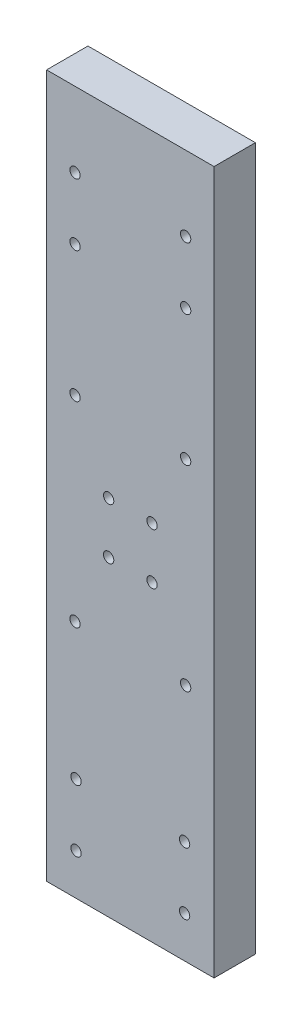
ISO-10303-21;
HEADER;
FILE_DESCRIPTION(('STEP AP214'),'2;1');
FILE_NAME('part.step','',(''),(''),'','','');
FILE_SCHEMA(('AUTOMOTIVE_DESIGN { 1 0 10303 214 1 1 1 1 }'));
ENDSEC;
DATA;
#1=APPLICATION_CONTEXT('core data for automotive mechanical design processes');
#2=APPLICATION_PROTOCOL_DEFINITION('international standard','automotive_design',2000,#1);
#3=PRODUCT_CONTEXT('',#1,'mechanical');
#4=PRODUCT('Part','Part','',(#3));
#5=PRODUCT_RELATED_PRODUCT_CATEGORY('part','',(#4));
#6=PRODUCT_DEFINITION_FORMATION('','',#4);
#7=PRODUCT_DEFINITION_CONTEXT('part definition',#1,'design');
#8=PRODUCT_DEFINITION('design','',#6,#7);
#9=PRODUCT_DEFINITION_SHAPE('','',#8);
#10=(LENGTH_UNIT() NAMED_UNIT(*) SI_UNIT(.MILLI.,.METRE.));
#11=(NAMED_UNIT(*) PLANE_ANGLE_UNIT() SI_UNIT($,.RADIAN.));
#12=(NAMED_UNIT(*) SI_UNIT($,.STERADIAN.) SOLID_ANGLE_UNIT());
#13=UNCERTAINTY_MEASURE_WITH_UNIT(LENGTH_MEASURE(1.E-05),#10,'distance_accuracy_value','');
#14=(GEOMETRIC_REPRESENTATION_CONTEXT(3) GLOBAL_UNCERTAINTY_ASSIGNED_CONTEXT((#13)) GLOBAL_UNIT_ASSIGNED_CONTEXT((#10,
#11,#12)) REPRESENTATION_CONTEXT('',''));
#15=CARTESIAN_POINT('',(0.,0.,0.));
#16=DIRECTION('',(0.,0.,1.));
#17=DIRECTION('',(1.,0.,0.));
#18=AXIS2_PLACEMENT_3D('',#15,#16,#17);
#19=CARTESIAN_POINT('',(0.,0.,4.));
#20=DIRECTION('',(0.,0.,-1.));
#21=DIRECTION('',(-1.,0.,0.));
#22=AXIS2_PLACEMENT_3D('',#19,#20,#21);
#23=PLANE('',#22);
#24=CARTESIAN_POINT('',(13.350000000001,4.,4.));
#25=DIRECTION('',(0.,0.,1.));
#26=DIRECTION('',(-1.,0.,0.));
#27=AXIS2_PLACEMENT_3D('',#24,#25,#26);
#28=CIRCLE('',#27,0.499999999999995);
#29=CARTESIAN_POINT('',(12.850000000001,4.,4.));
#30=VERTEX_POINT('',#29);
#31=EDGE_CURVE('E193',#30,#30,#28,.T.);
#32=ORIENTED_EDGE('',*,*,#31,.F.);
#33=EDGE_LOOP('',(#32));
#34=FACE_BOUND('',#33,.T.);
#35=CARTESIAN_POINT('',(2.84999999999999,4.,4.));
#36=DIRECTION('',(0.,0.,1.));
#37=DIRECTION('',(1.,0.,0.));
#38=AXIS2_PLACEMENT_3D('',#35,#36,#37);
#39=CIRCLE('',#38,0.499999999999999);
#40=CARTESIAN_POINT('',(3.34999999999999,4.,4.));
#41=VERTEX_POINT('',#40);
#42=EDGE_CURVE('E181',#41,#41,#39,.T.);
#43=ORIENTED_EDGE('',*,*,#42,.F.);
#44=EDGE_LOOP('',(#43));
#45=FACE_BOUND('',#44,.T.);
#46=CARTESIAN_POINT('',(2.75000000000003,42.11,4.));
#47=DIRECTION('',(0.,0.,1.));
#48=DIRECTION('',(1.,0.,0.));
#49=AXIS2_PLACEMENT_3D('',#46,#47,#48);
#50=CIRCLE('',#49,0.499999999999999);
#51=CARTESIAN_POINT('',(3.25000000000003,42.11,4.));
#52=VERTEX_POINT('',#51);
#53=EDGE_CURVE('E169',#52,#52,#50,.T.);
#54=ORIENTED_EDGE('',*,*,#53,.F.);
#55=EDGE_LOOP('',(#54));
#56=FACE_BOUND('',#55,.T.);
#57=CARTESIAN_POINT('',(13.45,42.11,4.));
#58=DIRECTION('',(0.,0.,1.));
#59=DIRECTION('',(1.,0.,0.));
#60=AXIS2_PLACEMENT_3D('',#57,#58,#59);
#61=CIRCLE('',#60,0.499999999999999);
#62=CARTESIAN_POINT('',(13.95,42.11,4.));
#63=VERTEX_POINT('',#62);
#64=EDGE_CURVE('E157',#63,#63,#61,.T.);
#65=ORIENTED_EDGE('',*,*,#64,.F.);
#66=EDGE_LOOP('',(#65));
#67=FACE_BOUND('',#66,.T.);
#68=CARTESIAN_POINT('',(2.75000000000003,23.15,4.));
#69=DIRECTION('',(0.,0.,1.));
#70=DIRECTION('',(1.,0.,0.));
#71=AXIS2_PLACEMENT_3D('',#68,#69,#70);
#72=CIRCLE('',#71,0.499999999999999);
#73=CARTESIAN_POINT('',(3.25000000000003,23.15,4.));
#74=VERTEX_POINT('',#73);
#75=EDGE_CURVE('E145',#74,#74,#72,.T.);
#76=ORIENTED_EDGE('',*,*,#75,.F.);
#77=EDGE_LOOP('',(#76));
#78=FACE_BOUND('',#77,.T.);
#79=CARTESIAN_POINT('',(13.4500000000001,23.15,4.));
#80=DIRECTION('',(0.,0.,1.));
#81=DIRECTION('',(1.,0.,0.));
#82=AXIS2_PLACEMENT_3D('',#79,#80,#81);
#83=CIRCLE('',#82,0.499999999999999);
#84=CARTESIAN_POINT('',(13.9500000000001,23.15,4.));
#85=VERTEX_POINT('',#84);
#86=EDGE_CURVE('E133',#85,#85,#83,.T.);
#87=ORIENTED_EDGE('',*,*,#86,.F.);
#88=EDGE_LOOP('',(#87));
#89=FACE_BOUND('',#88,.T.);
#90=CARTESIAN_POINT('',(10.2000000000001,30.15,4.));
#91=DIRECTION('',(0.,0.,1.));
#92=DIRECTION('',(1.,0.,0.));
#93=AXIS2_PLACEMENT_3D('',#90,#91,#92);
#94=CIRCLE('',#93,0.499999999999999);
#95=CARTESIAN_POINT('',(10.7000000000001,30.15,4.));
#96=VERTEX_POINT('',#95);
#97=EDGE_CURVE('E121',#96,#96,#94,.T.);
#98=ORIENTED_EDGE('',*,*,#97,.F.);
#99=EDGE_LOOP('',(#98));
#100=FACE_BOUND('',#99,.T.);
#101=CARTESIAN_POINT('',(13.45,60.76,4.));
#102=DIRECTION('',(0.,0.,1.));
#103=DIRECTION('',(1.,0.,0.));
#104=AXIS2_PLACEMENT_3D('',#101,#102,#103);
#105=CIRCLE('',#104,0.499999999999999);
#106=CARTESIAN_POINT('',(13.95,60.76,4.));
#107=VERTEX_POINT('',#106);
#108=EDGE_CURVE('E100',#107,#107,#105,.T.);
#109=ORIENTED_EDGE('',*,*,#108,.F.);
#110=EDGE_LOOP('',(#109));
#111=FACE_BOUND('',#110,.T.);
#112=DIRECTION('',(1.,0.,0.));
#113=VECTOR('',#112,1.);
#114=CARTESIAN_POINT('',(0.,0.,4.));
#115=LINE('',#114,#113);
#116=CARTESIAN_POINT('',(0.,0.,4.));
#117=VERTEX_POINT('',#116);
#118=CARTESIAN_POINT('',(16.2,0.,4.));
#119=VERTEX_POINT('',#118);
#120=EDGE_CURVE('E85',#117,#119,#115,.T.);
#121=ORIENTED_EDGE('',*,*,#120,.T.);
#122=DIRECTION('',(0.,1.,0.));
#123=VECTOR('',#122,1.);
#124=CARTESIAN_POINT('',(16.2,67.99,4.));
#125=LINE('',#124,#123);
#126=CARTESIAN_POINT('',(16.2,67.99,4.));
#127=VERTEX_POINT('',#126);
#128=EDGE_CURVE('E80',#119,#127,#125,.T.);
#129=ORIENTED_EDGE('',*,*,#128,.T.);
#130=DIRECTION('',(-1.,0.,0.));
#131=VECTOR('',#130,1.);
#132=CARTESIAN_POINT('',(0.,67.99,4.));
#133=LINE('',#132,#131);
#134=CARTESIAN_POINT('',(0.,67.99,4.));
#135=VERTEX_POINT('',#134);
#136=EDGE_CURVE('E83',#127,#135,#133,.T.);
#137=ORIENTED_EDGE('',*,*,#136,.T.);
#138=DIRECTION('',(0.,-1.,0.));
#139=VECTOR('',#138,1.);
#140=CARTESIAN_POINT('',(0.,0.,4.));
#141=LINE('',#140,#139);
#142=EDGE_CURVE('E50',#135,#117,#141,.T.);
#143=ORIENTED_EDGE('',*,*,#142,.T.);
#144=EDGE_LOOP('',(#121,#129,#137,#143));
#145=FACE_BOUND('',#144,.T.);
#146=CARTESIAN_POINT('',(2.75,60.76,4.));
#147=DIRECTION('',(0.,0.,1.));
#148=DIRECTION('',(1.,0.,0.));
#149=AXIS2_PLACEMENT_3D('',#146,#147,#148);
#150=CIRCLE('',#149,0.500000000000003);
#151=CARTESIAN_POINT('',(3.25,60.76,4.));
#152=VERTEX_POINT('',#151);
#153=EDGE_CURVE('E115',#152,#152,#150,.T.);
#154=ORIENTED_EDGE('',*,*,#153,.F.);
#155=EDGE_LOOP('',(#154));
#156=FACE_BOUND('',#155,.T.);
#157=CARTESIAN_POINT('',(6.00000000000001,30.15,4.));
#158=DIRECTION('',(0.,0.,1.));
#159=DIRECTION('',(1.,0.,0.));
#160=AXIS2_PLACEMENT_3D('',#157,#158,#159);
#161=CIRCLE('',#160,0.5);
#162=CARTESIAN_POINT('',(6.50000000000001,30.15,4.));
#163=VERTEX_POINT('',#162);
#164=EDGE_CURVE('E127',#163,#163,#161,.T.);
#165=ORIENTED_EDGE('',*,*,#164,.F.);
#166=EDGE_LOOP('',(#165));
#167=FACE_BOUND('',#166,.T.);
#168=CARTESIAN_POINT('',(10.2000000000001,35.11,4.));
#169=DIRECTION('',(0.,0.,1.));
#170=DIRECTION('',(1.,0.,0.));
#171=AXIS2_PLACEMENT_3D('',#168,#169,#170);
#172=CIRCLE('',#171,0.499999999999999);
#173=CARTESIAN_POINT('',(10.7000000000001,35.11,4.));
#174=VERTEX_POINT('',#173);
#175=EDGE_CURVE('E139',#174,#174,#172,.T.);
#176=ORIENTED_EDGE('',*,*,#175,.F.);
#177=EDGE_LOOP('',(#176));
#178=FACE_BOUND('',#177,.T.);
#179=CARTESIAN_POINT('',(6.00000000000001,35.11,4.));
#180=DIRECTION('',(0.,0.,1.));
#181=DIRECTION('',(1.,0.,0.));
#182=AXIS2_PLACEMENT_3D('',#179,#180,#181);
#183=CIRCLE('',#182,0.500000000000002);
#184=CARTESIAN_POINT('',(6.50000000000001,35.11,4.));
#185=VERTEX_POINT('',#184);
#186=EDGE_CURVE('E151',#185,#185,#183,.T.);
#187=ORIENTED_EDGE('',*,*,#186,.F.);
#188=EDGE_LOOP('',(#187));
#189=FACE_BOUND('',#188,.T.);
#190=CARTESIAN_POINT('',(2.84999999999999,10.,4.));
#191=DIRECTION('',(0.,0.,1.));
#192=DIRECTION('',(1.,0.,0.));
#193=AXIS2_PLACEMENT_3D('',#190,#191,#192);
#194=CIRCLE('',#193,0.499999999999999);
#195=CARTESIAN_POINT('',(3.34999999999999,10.,4.));
#196=VERTEX_POINT('',#195);
#197=EDGE_CURVE('E163',#196,#196,#194,.T.);
#198=ORIENTED_EDGE('',*,*,#197,.F.);
#199=EDGE_LOOP('',(#198));
#200=FACE_BOUND('',#199,.T.);
#201=CARTESIAN_POINT('',(13.4500000000019,54.76,4.));
#202=DIRECTION('',(0.,0.,1.));
#203=DIRECTION('',(1.,0.,0.));
#204=AXIS2_PLACEMENT_3D('',#201,#202,#203);
#205=CIRCLE('',#204,0.499999999999999);
#206=CARTESIAN_POINT('',(13.9500000000019,54.76,4.));
#207=VERTEX_POINT('',#206);
#208=EDGE_CURVE('E175',#207,#207,#205,.T.);
#209=ORIENTED_EDGE('',*,*,#208,.F.);
#210=EDGE_LOOP('',(#209));
#211=FACE_BOUND('',#210,.T.);
#212=CARTESIAN_POINT('',(13.350000000001,10.,4.));
#213=DIRECTION('',(0.,0.,1.));
#214=DIRECTION('',(-1.,0.,0.));
#215=AXIS2_PLACEMENT_3D('',#212,#213,#214);
#216=CIRCLE('',#215,0.499999999999994);
#217=CARTESIAN_POINT('',(12.850000000001,10.,4.));
#218=VERTEX_POINT('',#217);
#219=EDGE_CURVE('E187',#218,#218,#216,.T.);
#220=ORIENTED_EDGE('',*,*,#219,.F.);
#221=EDGE_LOOP('',(#220));
#222=FACE_BOUND('',#221,.T.);
#223=CARTESIAN_POINT('',(2.7500000000006,54.76,4.));
#224=DIRECTION('',(0.,0.,1.));
#225=DIRECTION('',(1.,0.,0.));
#226=AXIS2_PLACEMENT_3D('',#223,#224,#225);
#227=CIRCLE('',#226,0.500000000000005);
#228=CARTESIAN_POINT('',(3.2500000000006,54.76,4.));
#229=VERTEX_POINT('',#228);
#230=EDGE_CURVE('E199',#229,#229,#227,.T.);
#231=ORIENTED_EDGE('',*,*,#230,.F.);
#232=EDGE_LOOP('',(#231));
#233=FACE_BOUND('',#232,.T.);
#234=ADVANCED_FACE('F33',(#34,#45,#56,#67,#78,#89,#100,#111,#145,#156,#167,#178,#189,#200,#211,
#222,#233),#23,.F.);
#235=CARTESIAN_POINT('',(0.,0.,0.));
#236=DIRECTION('',(0.,0.,-1.));
#237=DIRECTION('',(-1.,0.,0.));
#238=AXIS2_PLACEMENT_3D('',#235,#236,#237);
#239=PLANE('',#238);
#240=CARTESIAN_POINT('',(13.350000000001,4.,0.));
#241=DIRECTION('',(0.,0.,1.));
#242=DIRECTION('',(-1.,0.,0.));
#243=AXIS2_PLACEMENT_3D('',#240,#241,#242);
#244=CIRCLE('',#243,0.499999999999995);
#245=CARTESIAN_POINT('',(12.850000000001,4.,0.));
#246=VERTEX_POINT('',#245);
#247=EDGE_CURVE('E196',#246,#246,#244,.T.);
#248=ORIENTED_EDGE('',*,*,#247,.T.);
#249=EDGE_LOOP('',(#248));
#250=FACE_BOUND('',#249,.T.);
#251=CARTESIAN_POINT('',(2.84999999999999,4.,0.));
#252=DIRECTION('',(0.,0.,1.));
#253=DIRECTION('',(1.,0.,0.));
#254=AXIS2_PLACEMENT_3D('',#251,#252,#253);
#255=CIRCLE('',#254,0.499999999999999);
#256=CARTESIAN_POINT('',(3.34999999999999,4.,0.));
#257=VERTEX_POINT('',#256);
#258=EDGE_CURVE('E184',#257,#257,#255,.T.);
#259=ORIENTED_EDGE('',*,*,#258,.T.);
#260=EDGE_LOOP('',(#259));
#261=FACE_BOUND('',#260,.T.);
#262=CARTESIAN_POINT('',(2.75000000000003,42.11,0.));
#263=DIRECTION('',(0.,0.,1.));
#264=DIRECTION('',(1.,0.,0.));
#265=AXIS2_PLACEMENT_3D('',#262,#263,#264);
#266=CIRCLE('',#265,0.499999999999999);
#267=CARTESIAN_POINT('',(3.25000000000003,42.11,0.));
#268=VERTEX_POINT('',#267);
#269=EDGE_CURVE('E172',#268,#268,#266,.T.);
#270=ORIENTED_EDGE('',*,*,#269,.T.);
#271=EDGE_LOOP('',(#270));
#272=FACE_BOUND('',#271,.T.);
#273=CARTESIAN_POINT('',(13.45,42.11,0.));
#274=DIRECTION('',(0.,0.,1.));
#275=DIRECTION('',(1.,0.,0.));
#276=AXIS2_PLACEMENT_3D('',#273,#274,#275);
#277=CIRCLE('',#276,0.499999999999999);
#278=CARTESIAN_POINT('',(13.95,42.11,0.));
#279=VERTEX_POINT('',#278);
#280=EDGE_CURVE('E160',#279,#279,#277,.T.);
#281=ORIENTED_EDGE('',*,*,#280,.T.);
#282=EDGE_LOOP('',(#281));
#283=FACE_BOUND('',#282,.T.);
#284=CARTESIAN_POINT('',(2.75000000000003,23.15,0.));
#285=DIRECTION('',(0.,0.,1.));
#286=DIRECTION('',(1.,0.,0.));
#287=AXIS2_PLACEMENT_3D('',#284,#285,#286);
#288=CIRCLE('',#287,0.499999999999999);
#289=CARTESIAN_POINT('',(3.25000000000003,23.15,0.));
#290=VERTEX_POINT('',#289);
#291=EDGE_CURVE('E148',#290,#290,#288,.T.);
#292=ORIENTED_EDGE('',*,*,#291,.T.);
#293=EDGE_LOOP('',(#292));
#294=FACE_BOUND('',#293,.T.);
#295=CARTESIAN_POINT('',(13.4500000000001,23.15,0.));
#296=DIRECTION('',(0.,0.,1.));
#297=DIRECTION('',(1.,0.,0.));
#298=AXIS2_PLACEMENT_3D('',#295,#296,#297);
#299=CIRCLE('',#298,0.499999999999999);
#300=CARTESIAN_POINT('',(13.9500000000001,23.15,0.));
#301=VERTEX_POINT('',#300);
#302=EDGE_CURVE('E136',#301,#301,#299,.T.);
#303=ORIENTED_EDGE('',*,*,#302,.T.);
#304=EDGE_LOOP('',(#303));
#305=FACE_BOUND('',#304,.T.);
#306=CARTESIAN_POINT('',(10.2000000000001,30.15,0.));
#307=DIRECTION('',(0.,0.,1.));
#308=DIRECTION('',(1.,0.,0.));
#309=AXIS2_PLACEMENT_3D('',#306,#307,#308);
#310=CIRCLE('',#309,0.499999999999999);
#311=CARTESIAN_POINT('',(10.7000000000001,30.15,0.));
#312=VERTEX_POINT('',#311);
#313=EDGE_CURVE('E124',#312,#312,#310,.T.);
#314=ORIENTED_EDGE('',*,*,#313,.T.);
#315=EDGE_LOOP('',(#314));
#316=FACE_BOUND('',#315,.T.);
#317=CARTESIAN_POINT('',(13.45,60.76,0.));
#318=DIRECTION('',(0.,0.,1.));
#319=DIRECTION('',(1.,0.,0.));
#320=AXIS2_PLACEMENT_3D('',#317,#318,#319);
#321=CIRCLE('',#320,0.499999999999999);
#322=CARTESIAN_POINT('',(13.95,60.76,0.));
#323=VERTEX_POINT('',#322);
#324=EDGE_CURVE('E112',#323,#323,#321,.T.);
#325=ORIENTED_EDGE('',*,*,#324,.T.);
#326=EDGE_LOOP('',(#325));
#327=FACE_BOUND('',#326,.T.);
#328=DIRECTION('',(1.,0.,0.));
#329=VECTOR('',#328,1.);
#330=CARTESIAN_POINT('',(0.,0.,0.));
#331=LINE('',#330,#329);
#332=CARTESIAN_POINT('',(0.,0.,0.));
#333=VERTEX_POINT('',#332);
#334=CARTESIAN_POINT('',(16.2,0.,0.));
#335=VERTEX_POINT('',#334);
#336=EDGE_CURVE('E97',#333,#335,#331,.T.);
#337=ORIENTED_EDGE('',*,*,#336,.F.);
#338=DIRECTION('',(0.,-1.,0.));
#339=VECTOR('',#338,1.);
#340=CARTESIAN_POINT('',(0.,0.,0.));
#341=LINE('',#340,#339);
#342=CARTESIAN_POINT('',(0.,67.99,0.));
#343=VERTEX_POINT('',#342);
#344=EDGE_CURVE('E73',#343,#333,#341,.T.);
#345=ORIENTED_EDGE('',*,*,#344,.F.);
#346=DIRECTION('',(-1.,0.,0.));
#347=VECTOR('',#346,1.);
#348=CARTESIAN_POINT('',(0.,67.99,0.));
#349=LINE('',#348,#347);
#350=CARTESIAN_POINT('',(16.2,67.99,0.));
#351=VERTEX_POINT('',#350);
#352=EDGE_CURVE('E67',#351,#343,#349,.T.);
#353=ORIENTED_EDGE('',*,*,#352,.F.);
#354=DIRECTION('',(0.,1.,0.));
#355=VECTOR('',#354,1.);
#356=CARTESIAN_POINT('',(16.2,67.99,0.));
#357=LINE('',#356,#355);
#358=EDGE_CURVE('E89',#335,#351,#357,.T.);
#359=ORIENTED_EDGE('',*,*,#358,.F.);
#360=EDGE_LOOP('',(#337,#345,#353,#359));
#361=FACE_BOUND('',#360,.T.);
#362=CARTESIAN_POINT('',(2.75,60.76,0.));
#363=DIRECTION('',(0.,0.,1.));
#364=DIRECTION('',(1.,0.,0.));
#365=AXIS2_PLACEMENT_3D('',#362,#363,#364);
#366=CIRCLE('',#365,0.500000000000003);
#367=CARTESIAN_POINT('',(3.25,60.76,0.));
#368=VERTEX_POINT('',#367);
#369=EDGE_CURVE('E118',#368,#368,#366,.T.);
#370=ORIENTED_EDGE('',*,*,#369,.T.);
#371=EDGE_LOOP('',(#370));
#372=FACE_BOUND('',#371,.T.);
#373=CARTESIAN_POINT('',(6.00000000000001,30.15,0.));
#374=DIRECTION('',(0.,0.,1.));
#375=DIRECTION('',(1.,0.,0.));
#376=AXIS2_PLACEMENT_3D('',#373,#374,#375);
#377=CIRCLE('',#376,0.5);
#378=CARTESIAN_POINT('',(6.50000000000001,30.15,0.));
#379=VERTEX_POINT('',#378);
#380=EDGE_CURVE('E130',#379,#379,#377,.T.);
#381=ORIENTED_EDGE('',*,*,#380,.T.);
#382=EDGE_LOOP('',(#381));
#383=FACE_BOUND('',#382,.T.);
#384=CARTESIAN_POINT('',(10.2000000000001,35.11,0.));
#385=DIRECTION('',(0.,0.,1.));
#386=DIRECTION('',(1.,0.,0.));
#387=AXIS2_PLACEMENT_3D('',#384,#385,#386);
#388=CIRCLE('',#387,0.499999999999999);
#389=CARTESIAN_POINT('',(10.7000000000001,35.11,0.));
#390=VERTEX_POINT('',#389);
#391=EDGE_CURVE('E142',#390,#390,#388,.T.);
#392=ORIENTED_EDGE('',*,*,#391,.T.);
#393=EDGE_LOOP('',(#392));
#394=FACE_BOUND('',#393,.T.);
#395=CARTESIAN_POINT('',(6.00000000000001,35.11,0.));
#396=DIRECTION('',(0.,0.,1.));
#397=DIRECTION('',(1.,0.,0.));
#398=AXIS2_PLACEMENT_3D('',#395,#396,#397);
#399=CIRCLE('',#398,0.500000000000002);
#400=CARTESIAN_POINT('',(6.50000000000001,35.11,0.));
#401=VERTEX_POINT('',#400);
#402=EDGE_CURVE('E154',#401,#401,#399,.T.);
#403=ORIENTED_EDGE('',*,*,#402,.T.);
#404=EDGE_LOOP('',(#403));
#405=FACE_BOUND('',#404,.T.);
#406=CARTESIAN_POINT('',(2.84999999999999,10.,0.));
#407=DIRECTION('',(0.,0.,1.));
#408=DIRECTION('',(1.,0.,0.));
#409=AXIS2_PLACEMENT_3D('',#406,#407,#408);
#410=CIRCLE('',#409,0.499999999999999);
#411=CARTESIAN_POINT('',(3.34999999999999,10.,0.));
#412=VERTEX_POINT('',#411);
#413=EDGE_CURVE('E166',#412,#412,#410,.T.);
#414=ORIENTED_EDGE('',*,*,#413,.T.);
#415=EDGE_LOOP('',(#414));
#416=FACE_BOUND('',#415,.T.);
#417=CARTESIAN_POINT('',(13.4500000000019,54.76,0.));
#418=DIRECTION('',(0.,0.,1.));
#419=DIRECTION('',(1.,0.,0.));
#420=AXIS2_PLACEMENT_3D('',#417,#418,#419);
#421=CIRCLE('',#420,0.499999999999999);
#422=CARTESIAN_POINT('',(13.9500000000019,54.76,0.));
#423=VERTEX_POINT('',#422);
#424=EDGE_CURVE('E178',#423,#423,#421,.T.);
#425=ORIENTED_EDGE('',*,*,#424,.T.);
#426=EDGE_LOOP('',(#425));
#427=FACE_BOUND('',#426,.T.);
#428=CARTESIAN_POINT('',(13.350000000001,10.,0.));
#429=DIRECTION('',(0.,0.,1.));
#430=DIRECTION('',(-1.,0.,0.));
#431=AXIS2_PLACEMENT_3D('',#428,#429,#430);
#432=CIRCLE('',#431,0.499999999999994);
#433=CARTESIAN_POINT('',(12.850000000001,10.,0.));
#434=VERTEX_POINT('',#433);
#435=EDGE_CURVE('E190',#434,#434,#432,.T.);
#436=ORIENTED_EDGE('',*,*,#435,.T.);
#437=EDGE_LOOP('',(#436));
#438=FACE_BOUND('',#437,.T.);
#439=CARTESIAN_POINT('',(2.7500000000006,54.76,0.));
#440=DIRECTION('',(0.,0.,1.));
#441=DIRECTION('',(1.,0.,0.));
#442=AXIS2_PLACEMENT_3D('',#439,#440,#441);
#443=CIRCLE('',#442,0.500000000000005);
#444=CARTESIAN_POINT('',(3.2500000000006,54.76,0.));
#445=VERTEX_POINT('',#444);
#446=EDGE_CURVE('E202',#445,#445,#443,.T.);
#447=ORIENTED_EDGE('',*,*,#446,.T.);
#448=EDGE_LOOP('',(#447));
#449=FACE_BOUND('',#448,.T.);
#450=ADVANCED_FACE('F108',(#250,#261,#272,#283,#294,#305,#316,#327,#361,#372,#383,#394,#405,
#416,#427,#438,#449),#239,.T.);
#451=CARTESIAN_POINT('',(0.,0.,4.));
#452=DIRECTION('',(0.,1.,0.));
#453=DIRECTION('',(0.,0.,1.));
#454=AXIS2_PLACEMENT_3D('',#451,#452,#453);
#455=PLANE('',#454);
#456=ORIENTED_EDGE('',*,*,#336,.T.);
#457=DIRECTION('',(0.,0.,-1.));
#458=VECTOR('',#457,1.);
#459=CARTESIAN_POINT('',(16.2,0.,4.));
#460=LINE('',#459,#458);
#461=EDGE_CURVE('E11',#119,#335,#460,.T.);
#462=ORIENTED_EDGE('',*,*,#461,.F.);
#463=ORIENTED_EDGE('',*,*,#120,.F.);
#464=DIRECTION('',(0.,0.,-1.));
#465=VECTOR('',#464,1.);
#466=CARTESIAN_POINT('',(0.,0.,4.));
#467=LINE('',#466,#465);
#468=EDGE_CURVE('E93',#117,#333,#467,.T.);
#469=ORIENTED_EDGE('',*,*,#468,.T.);
#470=EDGE_LOOP('',(#456,#462,#463,#469));
#471=FACE_BOUND('',#470,.T.);
#472=ADVANCED_FACE('F35',(#471),#455,.F.);
#473=CARTESIAN_POINT('',(16.2,67.99,4.));
#474=DIRECTION('',(-1.,0.,0.));
#475=DIRECTION('',(0.,-1.,0.));
#476=AXIS2_PLACEMENT_3D('',#473,#474,#475);
#477=PLANE('',#476);
#478=ORIENTED_EDGE('',*,*,#358,.T.);
#479=DIRECTION('',(0.,0.,-1.));
#480=VECTOR('',#479,1.);
#481=CARTESIAN_POINT('',(16.2,67.99,4.));
#482=LINE('',#481,#480);
#483=EDGE_CURVE('E42',#127,#351,#482,.T.);
#484=ORIENTED_EDGE('',*,*,#483,.F.);
#485=ORIENTED_EDGE('',*,*,#128,.F.);
#486=ORIENTED_EDGE('',*,*,#461,.T.);
#487=EDGE_LOOP('',(#478,#484,#485,#486));
#488=FACE_BOUND('',#487,.T.);
#489=ADVANCED_FACE('F88',(#488),#477,.F.);
#490=CARTESIAN_POINT('',(0.,67.99,4.));
#491=DIRECTION('',(0.,-1.,0.));
#492=DIRECTION('',(0.,0.,-1.));
#493=AXIS2_PLACEMENT_3D('',#490,#491,#492);
#494=PLANE('',#493);
#495=ORIENTED_EDGE('',*,*,#352,.T.);
#496=DIRECTION('',(0.,0.,-1.));
#497=VECTOR('',#496,1.);
#498=CARTESIAN_POINT('',(0.,67.99,4.));
#499=LINE('',#498,#497);
#500=EDGE_CURVE('E90',#135,#343,#499,.T.);
#501=ORIENTED_EDGE('',*,*,#500,.F.);
#502=ORIENTED_EDGE('',*,*,#136,.F.);
#503=ORIENTED_EDGE('',*,*,#483,.T.);
#504=EDGE_LOOP('',(#495,#501,#502,#503));
#505=FACE_BOUND('',#504,.T.);
#506=ADVANCED_FACE('F91',(#505),#494,.F.);
#507=CARTESIAN_POINT('',(0.,0.,4.));
#508=DIRECTION('',(1.,0.,0.));
#509=DIRECTION('',(0.,0.,-1.));
#510=AXIS2_PLACEMENT_3D('',#507,#508,#509);
#511=PLANE('',#510);
#512=ORIENTED_EDGE('',*,*,#344,.T.);
#513=ORIENTED_EDGE('',*,*,#468,.F.);
#514=ORIENTED_EDGE('',*,*,#142,.F.);
#515=ORIENTED_EDGE('',*,*,#500,.T.);
#516=EDGE_LOOP('',(#512,#513,#514,#515));
#517=FACE_BOUND('',#516,.T.);
#518=ADVANCED_FACE('F105',(#517),#511,.F.);
#519=CARTESIAN_POINT('',(13.45,60.76,4.));
#520=DIRECTION('',(0.,0.,-1.));
#521=DIRECTION('',(-1.,0.,0.));
#522=AXIS2_PLACEMENT_3D('',#519,#520,#521);
#523=CYLINDRICAL_SURFACE('',#522,0.499999999999999);
#524=ORIENTED_EDGE('',*,*,#108,.T.);
#525=EDGE_LOOP('',(#524));
#526=FACE_BOUND('',#525,.T.);
#527=ORIENTED_EDGE('',*,*,#324,.F.);
#528=EDGE_LOOP('',(#527));
#529=FACE_BOUND('',#528,.T.);
#530=ADVANCED_FACE('F222',(#526,#529),#523,.F.);
#531=CARTESIAN_POINT('',(2.75,60.76,4.));
#532=DIRECTION('',(0.,0.,-1.));
#533=DIRECTION('',(-1.,0.,0.));
#534=AXIS2_PLACEMENT_3D('',#531,#532,#533);
#535=CYLINDRICAL_SURFACE('',#534,0.500000000000003);
#536=ORIENTED_EDGE('',*,*,#153,.T.);
#537=EDGE_LOOP('',(#536));
#538=FACE_BOUND('',#537,.T.);
#539=ORIENTED_EDGE('',*,*,#369,.F.);
#540=EDGE_LOOP('',(#539));
#541=FACE_BOUND('',#540,.T.);
#542=ADVANCED_FACE('F268',(#538,#541),#535,.F.);
#543=CARTESIAN_POINT('',(10.2000000000001,30.15,4.));
#544=DIRECTION('',(0.,0.,-1.));
#545=DIRECTION('',(-1.,0.,0.));
#546=AXIS2_PLACEMENT_3D('',#543,#544,#545);
#547=CYLINDRICAL_SURFACE('',#546,0.499999999999999);
#548=ORIENTED_EDGE('',*,*,#97,.T.);
#549=EDGE_LOOP('',(#548));
#550=FACE_BOUND('',#549,.T.);
#551=ORIENTED_EDGE('',*,*,#313,.F.);
#552=EDGE_LOOP('',(#551));
#553=FACE_BOUND('',#552,.T.);
#554=ADVANCED_FACE('F276',(#550,#553),#547,.F.);
#555=CARTESIAN_POINT('',(6.00000000000001,30.15,4.));
#556=DIRECTION('',(0.,0.,-1.));
#557=DIRECTION('',(-1.,0.,0.));
#558=AXIS2_PLACEMENT_3D('',#555,#556,#557);
#559=CYLINDRICAL_SURFACE('',#558,0.5);
#560=ORIENTED_EDGE('',*,*,#164,.T.);
#561=EDGE_LOOP('',(#560));
#562=FACE_BOUND('',#561,.T.);
#563=ORIENTED_EDGE('',*,*,#380,.F.);
#564=EDGE_LOOP('',(#563));
#565=FACE_BOUND('',#564,.T.);
#566=ADVANCED_FACE('F284',(#562,#565),#559,.F.);
#567=CARTESIAN_POINT('',(13.4500000000001,23.15,4.));
#568=DIRECTION('',(0.,0.,-1.));
#569=DIRECTION('',(-1.,0.,0.));
#570=AXIS2_PLACEMENT_3D('',#567,#568,#569);
#571=CYLINDRICAL_SURFACE('',#570,0.499999999999999);
#572=ORIENTED_EDGE('',*,*,#86,.T.);
#573=EDGE_LOOP('',(#572));
#574=FACE_BOUND('',#573,.T.);
#575=ORIENTED_EDGE('',*,*,#302,.F.);
#576=EDGE_LOOP('',(#575));
#577=FACE_BOUND('',#576,.T.);
#578=ADVANCED_FACE('F293',(#574,#577),#571,.F.);
#579=CARTESIAN_POINT('',(10.2000000000001,35.11,4.));
#580=DIRECTION('',(0.,0.,-1.));
#581=DIRECTION('',(-1.,0.,0.));
#582=AXIS2_PLACEMENT_3D('',#579,#580,#581);
#583=CYLINDRICAL_SURFACE('',#582,0.499999999999999);
#584=ORIENTED_EDGE('',*,*,#175,.T.);
#585=EDGE_LOOP('',(#584));
#586=FACE_BOUND('',#585,.T.);
#587=ORIENTED_EDGE('',*,*,#391,.F.);
#588=EDGE_LOOP('',(#587));
#589=FACE_BOUND('',#588,.T.);
#590=ADVANCED_FACE('F302',(#586,#589),#583,.F.);
#591=CARTESIAN_POINT('',(2.75000000000003,23.15,4.));
#592=DIRECTION('',(0.,0.,-1.));
#593=DIRECTION('',(-1.,0.,0.));
#594=AXIS2_PLACEMENT_3D('',#591,#592,#593);
#595=CYLINDRICAL_SURFACE('',#594,0.499999999999999);
#596=ORIENTED_EDGE('',*,*,#75,.T.);
#597=EDGE_LOOP('',(#596));
#598=FACE_BOUND('',#597,.T.);
#599=ORIENTED_EDGE('',*,*,#291,.F.);
#600=EDGE_LOOP('',(#599));
#601=FACE_BOUND('',#600,.T.);
#602=ADVANCED_FACE('F311',(#598,#601),#595,.F.);
#603=CARTESIAN_POINT('',(6.00000000000001,35.11,4.));
#604=DIRECTION('',(0.,0.,-1.));
#605=DIRECTION('',(-1.,0.,0.));
#606=AXIS2_PLACEMENT_3D('',#603,#604,#605);
#607=CYLINDRICAL_SURFACE('',#606,0.500000000000002);
#608=ORIENTED_EDGE('',*,*,#186,.T.);
#609=EDGE_LOOP('',(#608));
#610=FACE_BOUND('',#609,.T.);
#611=ORIENTED_EDGE('',*,*,#402,.F.);
#612=EDGE_LOOP('',(#611));
#613=FACE_BOUND('',#612,.T.);
#614=ADVANCED_FACE('F320',(#610,#613),#607,.F.);
#615=CARTESIAN_POINT('',(13.45,42.11,4.));
#616=DIRECTION('',(0.,0.,-1.));
#617=DIRECTION('',(-1.,0.,0.));
#618=AXIS2_PLACEMENT_3D('',#615,#616,#617);
#619=CYLINDRICAL_SURFACE('',#618,0.499999999999999);
#620=ORIENTED_EDGE('',*,*,#64,.T.);
#621=EDGE_LOOP('',(#620));
#622=FACE_BOUND('',#621,.T.);
#623=ORIENTED_EDGE('',*,*,#280,.F.);
#624=EDGE_LOOP('',(#623));
#625=FACE_BOUND('',#624,.T.);
#626=ADVANCED_FACE('F329',(#622,#625),#619,.F.);
#627=CARTESIAN_POINT('',(2.84999999999999,10.,4.));
#628=DIRECTION('',(0.,0.,-1.));
#629=DIRECTION('',(-1.,0.,0.));
#630=AXIS2_PLACEMENT_3D('',#627,#628,#629);
#631=CYLINDRICAL_SURFACE('',#630,0.499999999999999);
#632=ORIENTED_EDGE('',*,*,#197,.T.);
#633=EDGE_LOOP('',(#632));
#634=FACE_BOUND('',#633,.T.);
#635=ORIENTED_EDGE('',*,*,#413,.F.);
#636=EDGE_LOOP('',(#635));
#637=FACE_BOUND('',#636,.T.);
#638=ADVANCED_FACE('F338',(#634,#637),#631,.F.);
#639=CARTESIAN_POINT('',(2.75000000000003,42.11,4.));
#640=DIRECTION('',(0.,0.,-1.));
#641=DIRECTION('',(-1.,0.,0.));
#642=AXIS2_PLACEMENT_3D('',#639,#640,#641);
#643=CYLINDRICAL_SURFACE('',#642,0.499999999999999);
#644=ORIENTED_EDGE('',*,*,#53,.T.);
#645=EDGE_LOOP('',(#644));
#646=FACE_BOUND('',#645,.T.);
#647=ORIENTED_EDGE('',*,*,#269,.F.);
#648=EDGE_LOOP('',(#647));
#649=FACE_BOUND('',#648,.T.);
#650=ADVANCED_FACE('F347',(#646,#649),#643,.F.);
#651=CARTESIAN_POINT('',(13.4500000000019,54.76,4.));
#652=DIRECTION('',(0.,0.,-1.));
#653=DIRECTION('',(-1.,0.,0.));
#654=AXIS2_PLACEMENT_3D('',#651,#652,#653);
#655=CYLINDRICAL_SURFACE('',#654,0.499999999999999);
#656=ORIENTED_EDGE('',*,*,#208,.T.);
#657=EDGE_LOOP('',(#656));
#658=FACE_BOUND('',#657,.T.);
#659=ORIENTED_EDGE('',*,*,#424,.F.);
#660=EDGE_LOOP('',(#659));
#661=FACE_BOUND('',#660,.T.);
#662=ADVANCED_FACE('F356',(#658,#661),#655,.F.);
#663=CARTESIAN_POINT('',(2.84999999999999,4.,4.));
#664=DIRECTION('',(0.,0.,-1.));
#665=DIRECTION('',(-1.,0.,0.));
#666=AXIS2_PLACEMENT_3D('',#663,#664,#665);
#667=CYLINDRICAL_SURFACE('',#666,0.499999999999999);
#668=ORIENTED_EDGE('',*,*,#42,.T.);
#669=EDGE_LOOP('',(#668));
#670=FACE_BOUND('',#669,.T.);
#671=ORIENTED_EDGE('',*,*,#258,.F.);
#672=EDGE_LOOP('',(#671));
#673=FACE_BOUND('',#672,.T.);
#674=ADVANCED_FACE('F365',(#670,#673),#667,.F.);
#675=CARTESIAN_POINT('',(13.350000000001,10.,4.));
#676=DIRECTION('',(0.,0.,-1.));
#677=DIRECTION('',(-1.,0.,0.));
#678=AXIS2_PLACEMENT_3D('',#675,#676,#677);
#679=CYLINDRICAL_SURFACE('',#678,0.499999999999994);
#680=ORIENTED_EDGE('',*,*,#219,.T.);
#681=EDGE_LOOP('',(#680));
#682=FACE_BOUND('',#681,.T.);
#683=ORIENTED_EDGE('',*,*,#435,.F.);
#684=EDGE_LOOP('',(#683));
#685=FACE_BOUND('',#684,.T.);
#686=ADVANCED_FACE('F374',(#682,#685),#679,.F.);
#687=CARTESIAN_POINT('',(13.350000000001,4.,4.));
#688=DIRECTION('',(0.,0.,-1.));
#689=DIRECTION('',(-1.,0.,0.));
#690=AXIS2_PLACEMENT_3D('',#687,#688,#689);
#691=CYLINDRICAL_SURFACE('',#690,0.499999999999995);
#692=ORIENTED_EDGE('',*,*,#31,.T.);
#693=EDGE_LOOP('',(#692));
#694=FACE_BOUND('',#693,.T.);
#695=ORIENTED_EDGE('',*,*,#247,.F.);
#696=EDGE_LOOP('',(#695));
#697=FACE_BOUND('',#696,.T.);
#698=ADVANCED_FACE('F383',(#694,#697),#691,.F.);
#699=CARTESIAN_POINT('',(2.7500000000006,54.76,4.));
#700=DIRECTION('',(0.,0.,-1.));
#701=DIRECTION('',(-1.,0.,0.));
#702=AXIS2_PLACEMENT_3D('',#699,#700,#701);
#703=CYLINDRICAL_SURFACE('',#702,0.500000000000005);
#704=ORIENTED_EDGE('',*,*,#230,.T.);
#705=EDGE_LOOP('',(#704));
#706=FACE_BOUND('',#705,.T.);
#707=ORIENTED_EDGE('',*,*,#446,.F.);
#708=EDGE_LOOP('',(#707));
#709=FACE_BOUND('',#708,.T.);
#710=ADVANCED_FACE('F208',(#706,#709),#703,.F.);
#711=CLOSED_SHELL('',(#234,#450,#472,#489,#506,#518,#530,#542,#554,#566,#578,#590,#602,#614,
#626,#638,#650,#662,#674,#686,#698,#710));
#712=MANIFOLD_SOLID_BREP('B2',#711);
#713=ADVANCED_BREP_SHAPE_REPRESENTATION('',(#18,#712),#14);
#714=SHAPE_DEFINITION_REPRESENTATION(#9,#713);
ENDSEC;
END-ISO-10303-21;
